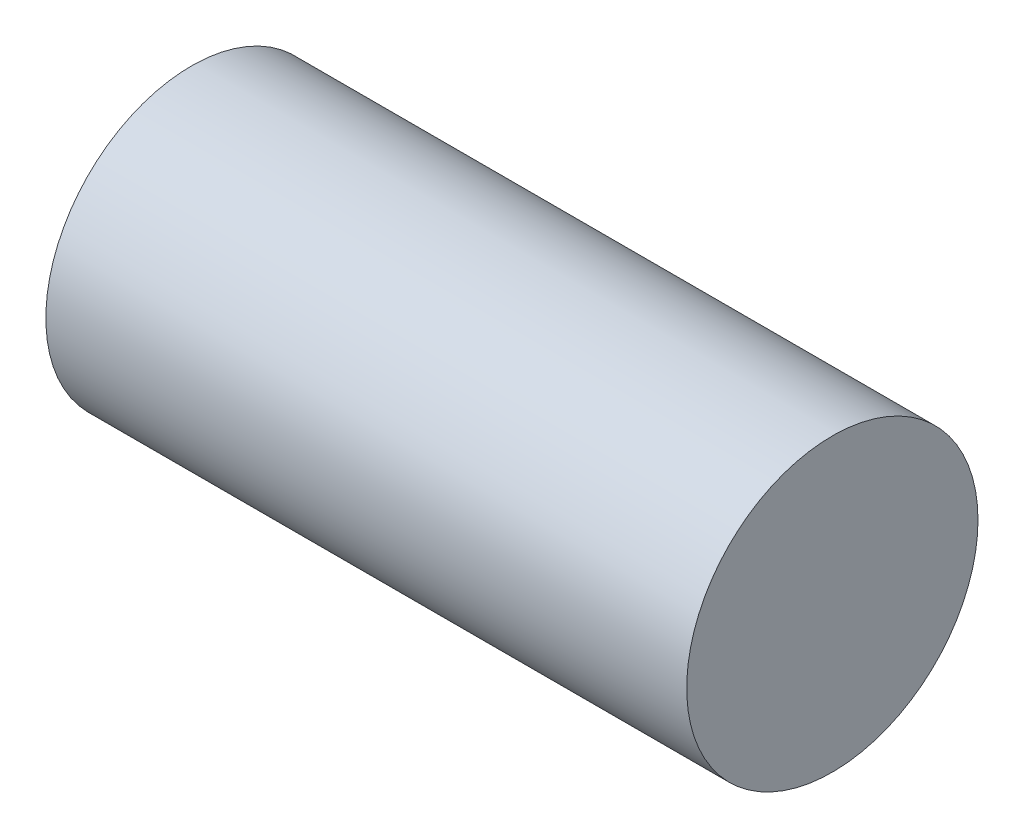
ISO-10303-21;
HEADER;
FILE_DESCRIPTION(('STEP AP214'),'2;1');
FILE_NAME('part.step','',(''),(''),'','','');
FILE_SCHEMA(('AUTOMOTIVE_DESIGN { 1 0 10303 214 1 1 1 1 }'));
ENDSEC;
DATA;
#1=APPLICATION_CONTEXT('core data for automotive mechanical design processes');
#2=APPLICATION_PROTOCOL_DEFINITION('international standard','automotive_design',2000,#1);
#3=PRODUCT_CONTEXT('',#1,'mechanical');
#4=PRODUCT('Part','Part','',(#3));
#5=PRODUCT_RELATED_PRODUCT_CATEGORY('part','',(#4));
#6=PRODUCT_DEFINITION_FORMATION('','',#4);
#7=PRODUCT_DEFINITION_CONTEXT('part definition',#1,'design');
#8=PRODUCT_DEFINITION('design','',#6,#7);
#9=PRODUCT_DEFINITION_SHAPE('','',#8);
#10=(LENGTH_UNIT() NAMED_UNIT(*) SI_UNIT(.MILLI.,.METRE.));
#11=(NAMED_UNIT(*) PLANE_ANGLE_UNIT() SI_UNIT($,.RADIAN.));
#12=(NAMED_UNIT(*) SI_UNIT($,.STERADIAN.) SOLID_ANGLE_UNIT());
#13=UNCERTAINTY_MEASURE_WITH_UNIT(LENGTH_MEASURE(1.E-05),#10,'distance_accuracy_value','');
#14=(GEOMETRIC_REPRESENTATION_CONTEXT(3) GLOBAL_UNCERTAINTY_ASSIGNED_CONTEXT((#13)) GLOBAL_UNIT_ASSIGNED_CONTEXT((#10,
#11,#12)) REPRESENTATION_CONTEXT('',''));
#15=CARTESIAN_POINT('',(0.,0.,0.));
#16=DIRECTION('',(0.,0.,1.));
#17=DIRECTION('',(1.,0.,0.));
#18=AXIS2_PLACEMENT_3D('',#15,#16,#17);
#19=CARTESIAN_POINT('',(5.588,0.,0.));
#20=DIRECTION('',(-1.,0.,0.));
#21=DIRECTION('',(0.,0.,1.));
#22=AXIS2_PLACEMENT_3D('',#19,#20,#21);
#23=CYLINDRICAL_SURFACE('',#22,1.27);
#24=CARTESIAN_POINT('',(5.588,0.,0.));
#25=DIRECTION('',(1.,0.,0.));
#26=DIRECTION('',(0.,0.,-1.));
#27=AXIS2_PLACEMENT_3D('',#24,#25,#26);
#28=CIRCLE('',#27,1.27);
#29=CARTESIAN_POINT('',(5.588,0.,-1.27));
#30=VERTEX_POINT('',#29);
#31=EDGE_CURVE('E10',#30,#30,#28,.T.);
#32=ORIENTED_EDGE('',*,*,#31,.F.);
#33=EDGE_LOOP('',(#32));
#34=FACE_BOUND('',#33,.T.);
#35=CARTESIAN_POINT('',(0.,0.,0.));
#36=DIRECTION('',(1.,0.,0.));
#37=DIRECTION('',(0.,0.,-1.));
#38=AXIS2_PLACEMENT_3D('',#35,#36,#37);
#39=CIRCLE('',#38,1.27);
#40=CARTESIAN_POINT('',(0.,0.,-1.27));
#41=VERTEX_POINT('',#40);
#42=EDGE_CURVE('E34',#41,#41,#39,.T.);
#43=ORIENTED_EDGE('',*,*,#42,.T.);
#44=EDGE_LOOP('',(#43));
#45=FACE_BOUND('',#44,.T.);
#46=ADVANCED_FACE('F31',(#34,#45),#23,.T.);
#47=CARTESIAN_POINT('',(5.588,0.,0.));
#48=DIRECTION('',(1.,0.,0.));
#49=DIRECTION('',(0.,0.,-1.));
#50=AXIS2_PLACEMENT_3D('',#47,#48,#49);
#51=PLANE('',#50);
#52=ORIENTED_EDGE('',*,*,#31,.T.);
#53=EDGE_LOOP('',(#52));
#54=FACE_BOUND('',#53,.T.);
#55=ADVANCED_FACE('F46',(#54),#51,.T.);
#56=CARTESIAN_POINT('',(0.,0.,0.));
#57=DIRECTION('',(1.,0.,0.));
#58=DIRECTION('',(0.,0.,-1.));
#59=AXIS2_PLACEMENT_3D('',#56,#57,#58);
#60=PLANE('',#59);
#61=ORIENTED_EDGE('',*,*,#42,.F.);
#62=EDGE_LOOP('',(#61));
#63=FACE_BOUND('',#62,.T.);
#64=ADVANCED_FACE('F44',(#63),#60,.F.);
#65=CLOSED_SHELL('',(#46,#55,#64));
#66=MANIFOLD_SOLID_BREP('B2',#65);
#67=ADVANCED_BREP_SHAPE_REPRESENTATION('',(#18,#66),#14);
#68=SHAPE_DEFINITION_REPRESENTATION(#9,#67);
ENDSEC;
END-ISO-10303-21;
